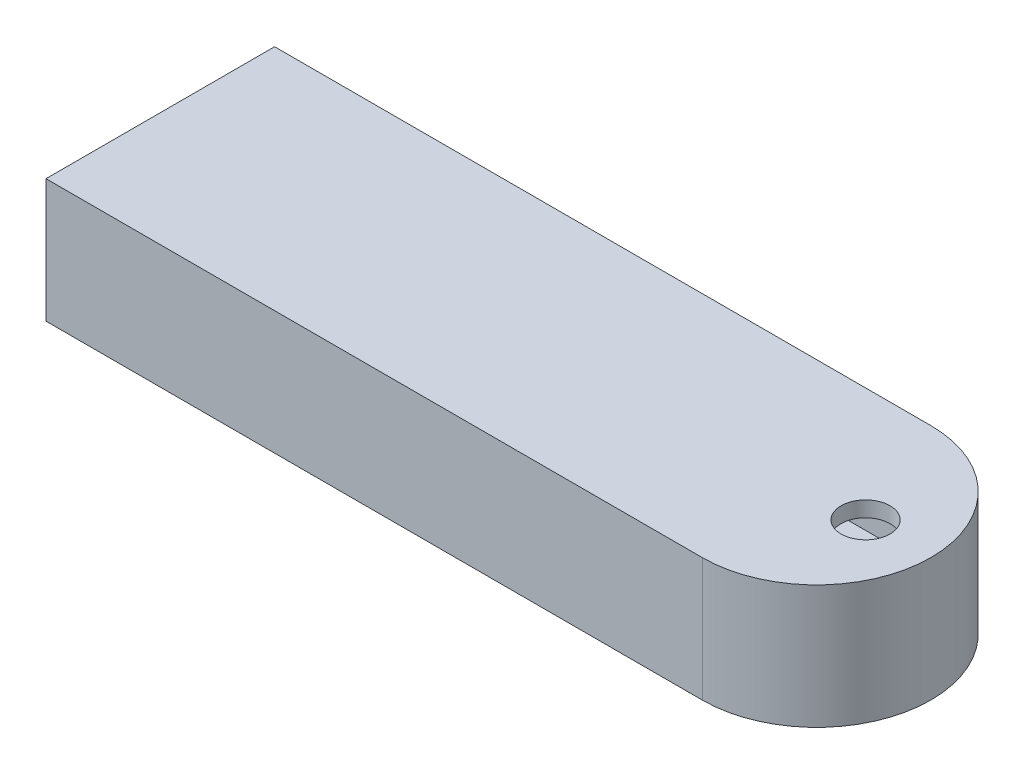
ISO-10303-21;
HEADER;
FILE_DESCRIPTION(('STEP AP214'),'2;1');
FILE_NAME('part.step','',(''),(''),'','','');
FILE_SCHEMA(('AUTOMOTIVE_DESIGN { 1 0 10303 214 1 1 1 1 }'));
ENDSEC;
DATA;
#1=APPLICATION_CONTEXT('core data for automotive mechanical design processes');
#2=APPLICATION_PROTOCOL_DEFINITION('international standard','automotive_design',2000,#1);
#3=PRODUCT_CONTEXT('',#1,'mechanical');
#4=PRODUCT('Part','Part','',(#3));
#5=PRODUCT_RELATED_PRODUCT_CATEGORY('part','',(#4));
#6=PRODUCT_DEFINITION_FORMATION('','',#4);
#7=PRODUCT_DEFINITION_CONTEXT('part definition',#1,'design');
#8=PRODUCT_DEFINITION('design','',#6,#7);
#9=PRODUCT_DEFINITION_SHAPE('','',#8);
#10=(LENGTH_UNIT() NAMED_UNIT(*) SI_UNIT(.MILLI.,.METRE.));
#11=(NAMED_UNIT(*) PLANE_ANGLE_UNIT() SI_UNIT($,.RADIAN.));
#12=(NAMED_UNIT(*) SI_UNIT($,.STERADIAN.) SOLID_ANGLE_UNIT());
#13=UNCERTAINTY_MEASURE_WITH_UNIT(LENGTH_MEASURE(1.E-05),#10,'distance_accuracy_value','');
#14=(GEOMETRIC_REPRESENTATION_CONTEXT(3) GLOBAL_UNCERTAINTY_ASSIGNED_CONTEXT((#13)) GLOBAL_UNIT_ASSIGNED_CONTEXT((#10,
#11,#12)) REPRESENTATION_CONTEXT('',''));
#15=CARTESIAN_POINT('',(0.,0.,0.));
#16=DIRECTION('',(0.,0.,1.));
#17=DIRECTION('',(1.,0.,0.));
#18=AXIS2_PLACEMENT_3D('',#15,#16,#17);
#19=CARTESIAN_POINT('',(33.4983346988671,15.9,-1.61404176251173));
#20=DIRECTION('',(0.,-1.,0.));
#21=DIRECTION('',(0.,0.,-1.));
#22=AXIS2_PLACEMENT_3D('',#19,#20,#21);
#23=CYLINDRICAL_SURFACE('',#22,3.155);
#24=CARTESIAN_POINT('',(33.4983346988671,13.9,-1.61404176251173));
#25=DIRECTION('',(0.,1.,0.));
#26=DIRECTION('',(0.,0.,1.));
#27=AXIS2_PLACEMENT_3D('',#24,#25,#26);
#28=CIRCLE('',#27,3.155);
#29=CARTESIAN_POINT('',(33.4983346988671,13.9,1.54095823748827));
#30=VERTEX_POINT('',#29);
#31=EDGE_CURVE('E178',#30,#30,#28,.T.);
#32=ORIENTED_EDGE('',*,*,#31,.F.);
#33=EDGE_LOOP('',(#32));
#34=FACE_BOUND('',#33,.T.);
#35=CARTESIAN_POINT('',(33.4983346988671,15.9,-1.61404176251173));
#36=DIRECTION('',(0.,1.,0.));
#37=DIRECTION('',(0.,0.,1.));
#38=AXIS2_PLACEMENT_3D('',#35,#36,#37);
#39=CIRCLE('',#38,3.155);
#40=CARTESIAN_POINT('',(33.4983346988671,15.9,1.54095823748827));
#41=VERTEX_POINT('',#40);
#42=EDGE_CURVE('E220',#41,#41,#39,.T.);
#43=ORIENTED_EDGE('',*,*,#42,.T.);
#44=EDGE_LOOP('',(#43));
#45=FACE_BOUND('',#44,.T.);
#46=ADVANCED_FACE('F64',(#34,#45),#23,.F.);
#47=CARTESIAN_POINT('',(-57.361665301133,15.9,-16.3390417625117));
#48=DIRECTION('',(1.,0.,0.));
#49=DIRECTION('',(0.,0.,-1.));
#50=AXIS2_PLACEMENT_3D('',#47,#48,#49);
#51=PLANE('',#50);
#52=DIRECTION('',(0.,0.,1.));
#53=VECTOR('',#52,1.);
#54=CARTESIAN_POINT('',(-57.361665301133,0.,-16.3390417625117));
#55=LINE('',#54,#53);
#56=CARTESIAN_POINT('',(-57.361665301133,0.,-16.3390417625117));
#57=VERTEX_POINT('',#56);
#58=CARTESIAN_POINT('',(-57.361665301133,0.,13.1109582374883));
#59=VERTEX_POINT('',#58);
#60=EDGE_CURVE('E194',#57,#59,#55,.T.);
#61=ORIENTED_EDGE('',*,*,#60,.T.);
#62=DIRECTION('',(0.,-1.,0.));
#63=VECTOR('',#62,1.);
#64=CARTESIAN_POINT('',(-57.361665301133,15.9,13.1109582374883));
#65=LINE('',#64,#63);
#66=CARTESIAN_POINT('',(-57.361665301133,15.9,13.1109582374883));
#67=VERTEX_POINT('',#66);
#68=EDGE_CURVE('E74',#67,#59,#65,.T.);
#69=ORIENTED_EDGE('',*,*,#68,.F.);
#70=DIRECTION('',(0.,0.,1.));
#71=VECTOR('',#70,1.);
#72=CARTESIAN_POINT('',(-57.361665301133,15.9,-16.3390417625117));
#73=LINE('',#72,#71);
#74=CARTESIAN_POINT('',(-57.361665301133,15.9,-16.3390417625117));
#75=VERTEX_POINT('',#74);
#76=EDGE_CURVE('E198',#75,#67,#73,.T.);
#77=ORIENTED_EDGE('',*,*,#76,.F.);
#78=DIRECTION('',(0.,-1.,0.));
#79=VECTOR('',#78,1.);
#80=CARTESIAN_POINT('',(-57.361665301133,15.9,-16.3390417625117));
#81=LINE('',#80,#79);
#82=EDGE_CURVE('E12',#75,#57,#81,.T.);
#83=ORIENTED_EDGE('',*,*,#82,.T.);
#84=EDGE_LOOP('',(#61,#69,#77,#83));
#85=FACE_BOUND('',#84,.T.);
#86=DIRECTION('',(0.,0.,1.));
#87=VECTOR('',#86,1.);
#88=CARTESIAN_POINT('',(-57.361665301133,2.,0.));
#89=LINE('',#88,#87);
#90=CARTESIAN_POINT('',(-57.361665301133,2.,-14.3390417625117));
#91=VERTEX_POINT('',#90);
#92=CARTESIAN_POINT('',(-57.361665301133,2.,11.1109582374883));
#93=VERTEX_POINT('',#92);
#94=EDGE_CURVE('E170',#91,#93,#89,.T.);
#95=ORIENTED_EDGE('',*,*,#94,.F.);
#96=DIRECTION('',(0.,-1.,0.));
#97=VECTOR('',#96,1.);
#98=CARTESIAN_POINT('',(-57.361665301133,15.9,-14.3390417625117));
#99=LINE('',#98,#97);
#100=CARTESIAN_POINT('',(-57.361665301133,13.9,-14.3390417625117));
#101=VERTEX_POINT('',#100);
#102=EDGE_CURVE('E183',#101,#91,#99,.T.);
#103=ORIENTED_EDGE('',*,*,#102,.F.);
#104=DIRECTION('',(0.,0.,1.));
#105=VECTOR('',#104,1.);
#106=CARTESIAN_POINT('',(-57.361665301133,13.9,0.));
#107=LINE('',#106,#105);
#108=CARTESIAN_POINT('',(-57.361665301133,13.9,11.1109582374883));
#109=VERTEX_POINT('',#108);
#110=EDGE_CURVE('E164',#101,#109,#107,.T.);
#111=ORIENTED_EDGE('',*,*,#110,.T.);
#112=DIRECTION('',(0.,-1.,0.));
#113=VECTOR('',#112,1.);
#114=CARTESIAN_POINT('',(-57.361665301133,15.9,11.1109582374883));
#115=LINE('',#114,#113);
#116=EDGE_CURVE('E149',#109,#93,#115,.T.);
#117=ORIENTED_EDGE('',*,*,#116,.T.);
#118=EDGE_LOOP('',(#95,#103,#111,#117));
#119=FACE_BOUND('',#118,.T.);
#120=ADVANCED_FACE('F240',(#85,#119),#51,.F.);
#121=CARTESIAN_POINT('',(-57.361665301133,15.9,13.1109582374883));
#122=DIRECTION('',(0.,0.,-1.));
#123=DIRECTION('',(-1.,0.,0.));
#124=AXIS2_PLACEMENT_3D('',#121,#122,#123);
#125=PLANE('',#124);
#126=DIRECTION('',(1.,0.,0.));
#127=VECTOR('',#126,1.);
#128=CARTESIAN_POINT('',(-57.361665301133,0.,13.1109582374883));
#129=LINE('',#128,#127);
#130=CARTESIAN_POINT('',(27.188334698867,0.,13.1109582374882));
#131=VERTEX_POINT('',#130);
#132=EDGE_CURVE('E205',#59,#131,#129,.T.);
#133=ORIENTED_EDGE('',*,*,#132,.T.);
#134=DIRECTION('',(0.,-1.,0.));
#135=VECTOR('',#134,1.);
#136=CARTESIAN_POINT('',(27.188334698867,15.9,13.1109582374882));
#137=LINE('',#136,#135);
#138=CARTESIAN_POINT('',(27.188334698867,15.9,13.1109582374882));
#139=VERTEX_POINT('',#138);
#140=EDGE_CURVE('E215',#139,#131,#137,.T.);
#141=ORIENTED_EDGE('',*,*,#140,.F.);
#142=DIRECTION('',(1.,0.,0.));
#143=VECTOR('',#142,1.);
#144=CARTESIAN_POINT('',(-57.361665301133,15.9,13.1109582374883));
#145=LINE('',#144,#143);
#146=EDGE_CURVE('E193',#67,#139,#145,.T.);
#147=ORIENTED_EDGE('',*,*,#146,.F.);
#148=ORIENTED_EDGE('',*,*,#68,.T.);
#149=EDGE_LOOP('',(#133,#141,#147,#148));
#150=FACE_BOUND('',#149,.T.);
#151=ADVANCED_FACE('F243',(#150),#125,.F.);
#152=CARTESIAN_POINT('',(-57.361665301133,15.9,-16.3390417625117));
#153=DIRECTION('',(0.,0.,-1.));
#154=DIRECTION('',(-1.,0.,0.));
#155=AXIS2_PLACEMENT_3D('',#152,#153,#154);
#156=PLANE('',#155);
#157=DIRECTION('',(1.,0.,0.));
#158=VECTOR('',#157,1.);
#159=CARTESIAN_POINT('',(-57.361665301133,0.,-16.3390417625117));
#160=LINE('',#159,#158);
#161=CARTESIAN_POINT('',(27.188334698867,0.,-16.3390417625117));
#162=VERTEX_POINT('',#161);
#163=EDGE_CURVE('E201',#57,#162,#160,.T.);
#164=ORIENTED_EDGE('',*,*,#163,.F.);
#165=ORIENTED_EDGE('',*,*,#82,.F.);
#166=DIRECTION('',(1.,0.,0.));
#167=VECTOR('',#166,1.);
#168=CARTESIAN_POINT('',(-57.361665301133,15.9,-16.3390417625117));
#169=LINE('',#168,#167);
#170=CARTESIAN_POINT('',(27.188334698867,15.9,-16.3390417625117));
#171=VERTEX_POINT('',#170);
#172=EDGE_CURVE('E190',#75,#171,#169,.T.);
#173=ORIENTED_EDGE('',*,*,#172,.T.);
#174=DIRECTION('',(0.,-1.,0.));
#175=VECTOR('',#174,1.);
#176=CARTESIAN_POINT('',(27.188334698867,15.9,-16.3390417625117));
#177=LINE('',#176,#175);
#178=EDGE_CURVE('E114',#171,#162,#177,.T.);
#179=ORIENTED_EDGE('',*,*,#178,.T.);
#180=EDGE_LOOP('',(#164,#165,#173,#179));
#181=FACE_BOUND('',#180,.T.);
#182=ADVANCED_FACE('F235',(#181),#156,.T.);
#183=CARTESIAN_POINT('',(0.,0.,0.));
#184=DIRECTION('',(0.,-1.,0.));
#185=DIRECTION('',(0.,0.,-1.));
#186=AXIS2_PLACEMENT_3D('',#183,#184,#185);
#187=PLANE('',#186);
#188=ORIENTED_EDGE('',*,*,#163,.T.);
#189=CARTESIAN_POINT('',(27.188334698867,0.,-1.61404176251173));
#190=DIRECTION('',(0.,1.,0.));
#191=DIRECTION('',(0.,0.,1.));
#192=AXIS2_PLACEMENT_3D('',#189,#190,#191);
#193=CIRCLE('',#192,14.7249999999999);
#194=EDGE_CURVE('E68',#131,#162,#193,.T.);
#195=ORIENTED_EDGE('',*,*,#194,.F.);
#196=ORIENTED_EDGE('',*,*,#132,.F.);
#197=ORIENTED_EDGE('',*,*,#60,.F.);
#198=EDGE_LOOP('',(#188,#195,#196,#197));
#199=FACE_BOUND('',#198,.T.);
#200=CARTESIAN_POINT('',(33.4983346988671,0.,-1.61404176251173));
#201=DIRECTION('',(0.,1.,0.));
#202=DIRECTION('',(0.,0.,1.));
#203=AXIS2_PLACEMENT_3D('',#200,#201,#202);
#204=CIRCLE('',#203,3.155);
#205=CARTESIAN_POINT('',(33.4983346988671,0.,1.54095823748827));
#206=VERTEX_POINT('',#205);
#207=EDGE_CURVE('E187',#206,#206,#204,.T.);
#208=ORIENTED_EDGE('',*,*,#207,.T.);
#209=EDGE_LOOP('',(#208));
#210=FACE_BOUND('',#209,.T.);
#211=ADVANCED_FACE('F233',(#199,#210),#187,.T.);
#212=CARTESIAN_POINT('',(0.,15.9,0.));
#213=DIRECTION('',(0.,-1.,0.));
#214=DIRECTION('',(0.,0.,-1.));
#215=AXIS2_PLACEMENT_3D('',#212,#213,#214);
#216=PLANE('',#215);
#217=ORIENTED_EDGE('',*,*,#146,.T.);
#218=CARTESIAN_POINT('',(27.188334698867,15.9,-1.61404176251173));
#219=DIRECTION('',(0.,1.,0.));
#220=DIRECTION('',(0.,0.,1.));
#221=AXIS2_PLACEMENT_3D('',#218,#219,#220);
#222=CIRCLE('',#221,14.7249999999999);
#223=EDGE_CURVE('E206',#139,#171,#222,.T.);
#224=ORIENTED_EDGE('',*,*,#223,.T.);
#225=ORIENTED_EDGE('',*,*,#172,.F.);
#226=ORIENTED_EDGE('',*,*,#76,.T.);
#227=EDGE_LOOP('',(#217,#224,#225,#226));
#228=FACE_BOUND('',#227,.T.);
#229=ORIENTED_EDGE('',*,*,#42,.F.);
#230=EDGE_LOOP('',(#229));
#231=FACE_BOUND('',#230,.T.);
#232=ADVANCED_FACE('F236',(#228,#231),#216,.F.);
#233=CARTESIAN_POINT('',(33.4983346988671,2.,-1.61404176251173));
#234=DIRECTION('',(0.,-1.,0.));
#235=DIRECTION('',(0.,0.,-1.));
#236=AXIS2_PLACEMENT_3D('',#233,#234,#235);
#237=CIRCLE('',#236,3.155);
#238=CARTESIAN_POINT('',(33.4983346988671,2.,-4.76904176251173));
#239=VERTEX_POINT('',#238);
#240=EDGE_CURVE('E378',#239,#239,#237,.T.);
#241=ORIENTED_EDGE('',*,*,#240,.F.);
#242=EDGE_LOOP('',(#241));
#243=FACE_BOUND('',#242,.T.);
#244=ORIENTED_EDGE('',*,*,#207,.F.);
#245=EDGE_LOOP('',(#244));
#246=FACE_BOUND('',#245,.T.);
#247=ADVANCED_FACE('F253',(#243,#246),#23,.F.);
#248=CARTESIAN_POINT('',(27.188334698867,15.9,-1.61404176251173));
#249=DIRECTION('',(0.,-1.,0.));
#250=DIRECTION('',(0.,0.,-1.));
#251=AXIS2_PLACEMENT_3D('',#248,#249,#250);
#252=CYLINDRICAL_SURFACE('',#251,14.7249999999999);
#253=ORIENTED_EDGE('',*,*,#140,.T.);
#254=ORIENTED_EDGE('',*,*,#194,.T.);
#255=ORIENTED_EDGE('',*,*,#178,.F.);
#256=ORIENTED_EDGE('',*,*,#223,.F.);
#257=EDGE_LOOP('',(#253,#254,#255,#256));
#258=FACE_BOUND('',#257,.T.);
#259=ADVANCED_FACE('F66',(#258),#252,.T.);
#260=CARTESIAN_POINT('',(-57.361665301133,15.9,11.1109582374883));
#261=DIRECTION('',(0.,0.,-1.));
#262=DIRECTION('',(-1.,0.,0.));
#263=AXIS2_PLACEMENT_3D('',#260,#261,#262);
#264=PLANE('',#263);
#265=DIRECTION('',(1.,0.,0.));
#266=VECTOR('',#265,1.);
#267=CARTESIAN_POINT('',(0.,2.,11.1109582374883));
#268=LINE('',#267,#266);
#269=CARTESIAN_POINT('',(27.188334698867,2.,11.1109582374882));
#270=VERTEX_POINT('',#269);
#271=EDGE_CURVE('E177',#93,#270,#268,.T.);
#272=ORIENTED_EDGE('',*,*,#271,.F.);
#273=ORIENTED_EDGE('',*,*,#116,.F.);
#274=DIRECTION('',(1.,0.,0.));
#275=VECTOR('',#274,1.);
#276=CARTESIAN_POINT('',(0.,13.9,11.1109582374883));
#277=LINE('',#276,#275);
#278=CARTESIAN_POINT('',(27.188334698867,13.9,11.1109582374882));
#279=VERTEX_POINT('',#278);
#280=EDGE_CURVE('E156',#109,#279,#277,.T.);
#281=ORIENTED_EDGE('',*,*,#280,.T.);
#282=DIRECTION('',(0.,-1.,0.));
#283=VECTOR('',#282,1.);
#284=CARTESIAN_POINT('',(27.188334698867,15.9,11.1109582374882));
#285=LINE('',#284,#283);
#286=EDGE_CURVE('E138',#279,#270,#285,.T.);
#287=ORIENTED_EDGE('',*,*,#286,.T.);
#288=EDGE_LOOP('',(#272,#273,#281,#287));
#289=FACE_BOUND('',#288,.T.);
#290=ADVANCED_FACE('F161',(#289),#264,.T.);
#291=CARTESIAN_POINT('',(-57.361665301133,15.9,-14.3390417625117));
#292=DIRECTION('',(0.,0.,-1.));
#293=DIRECTION('',(-1.,0.,0.));
#294=AXIS2_PLACEMENT_3D('',#291,#292,#293);
#295=PLANE('',#294);
#296=DIRECTION('',(1.,0.,0.));
#297=VECTOR('',#296,1.);
#298=CARTESIAN_POINT('',(0.,2.,-14.3390417625117));
#299=LINE('',#298,#297);
#300=CARTESIAN_POINT('',(27.188334698867,2.,-14.3390417625117));
#301=VERTEX_POINT('',#300);
#302=EDGE_CURVE('E159',#91,#301,#299,.T.);
#303=ORIENTED_EDGE('',*,*,#302,.T.);
#304=DIRECTION('',(0.,1.,0.));
#305=VECTOR('',#304,1.);
#306=CARTESIAN_POINT('',(27.188334698867,15.9,-14.3390417625117));
#307=LINE('',#306,#305);
#308=CARTESIAN_POINT('',(27.188334698867,13.9,-14.3390417625117));
#309=VERTEX_POINT('',#308);
#310=EDGE_CURVE('E150',#309,#301,#307,.F.);
#311=ORIENTED_EDGE('',*,*,#310,.F.);
#312=DIRECTION('',(1.,0.,0.));
#313=VECTOR('',#312,1.);
#314=CARTESIAN_POINT('',(0.,13.9,-14.3390417625117));
#315=LINE('',#314,#313);
#316=EDGE_CURVE('E82',#101,#309,#315,.T.);
#317=ORIENTED_EDGE('',*,*,#316,.F.);
#318=ORIENTED_EDGE('',*,*,#102,.T.);
#319=EDGE_LOOP('',(#303,#311,#317,#318));
#320=FACE_BOUND('',#319,.T.);
#321=ADVANCED_FACE('F266',(#320),#295,.F.);
#322=CARTESIAN_POINT('',(0.,2.,0.));
#323=DIRECTION('',(0.,-1.,0.));
#324=DIRECTION('',(0.,0.,-1.));
#325=AXIS2_PLACEMENT_3D('',#322,#323,#324);
#326=PLANE('',#325);
#327=ORIENTED_EDGE('',*,*,#302,.F.);
#328=ORIENTED_EDGE('',*,*,#94,.T.);
#329=ORIENTED_EDGE('',*,*,#271,.T.);
#330=CARTESIAN_POINT('',(27.188334698867,2.,-1.61404176251173));
#331=DIRECTION('',(0.,-1.,0.));
#332=DIRECTION('',(0.,0.,-1.));
#333=AXIS2_PLACEMENT_3D('',#330,#331,#332);
#334=CIRCLE('',#333,12.7249999999999);
#335=EDGE_CURVE('E143',#270,#301,#334,.F.);
#336=ORIENTED_EDGE('',*,*,#335,.T.);
#337=EDGE_LOOP('',(#327,#328,#329,#336));
#338=FACE_BOUND('',#337,.T.);
#339=ORIENTED_EDGE('',*,*,#240,.T.);
#340=EDGE_LOOP('',(#339));
#341=FACE_BOUND('',#340,.T.);
#342=ADVANCED_FACE('F270',(#338,#341),#326,.F.);
#343=CARTESIAN_POINT('',(0.,13.9,0.));
#344=DIRECTION('',(0.,-1.,0.));
#345=DIRECTION('',(0.,0.,-1.));
#346=AXIS2_PLACEMENT_3D('',#343,#344,#345);
#347=PLANE('',#346);
#348=ORIENTED_EDGE('',*,*,#280,.F.);
#349=ORIENTED_EDGE('',*,*,#110,.F.);
#350=ORIENTED_EDGE('',*,*,#316,.T.);
#351=CARTESIAN_POINT('',(27.188334698867,13.9,-1.61404176251173));
#352=DIRECTION('',(0.,-1.,0.));
#353=DIRECTION('',(0.,0.,-1.));
#354=AXIS2_PLACEMENT_3D('',#351,#352,#353);
#355=CIRCLE('',#354,12.7249999999999);
#356=EDGE_CURVE('E141',#279,#309,#355,.F.);
#357=ORIENTED_EDGE('',*,*,#356,.F.);
#358=EDGE_LOOP('',(#348,#349,#350,#357));
#359=FACE_BOUND('',#358,.T.);
#360=ORIENTED_EDGE('',*,*,#31,.T.);
#361=EDGE_LOOP('',(#360));
#362=FACE_BOUND('',#361,.T.);
#363=ADVANCED_FACE('F154',(#359,#362),#347,.T.);
#364=CARTESIAN_POINT('',(27.188334698867,15.9,-1.61404176251173));
#365=DIRECTION('',(0.,-1.,0.));
#366=DIRECTION('',(0.,0.,-1.));
#367=AXIS2_PLACEMENT_3D('',#364,#365,#366);
#368=CYLINDRICAL_SURFACE('',#367,12.7249999999999);
#369=ORIENTED_EDGE('',*,*,#286,.F.);
#370=ORIENTED_EDGE('',*,*,#356,.T.);
#371=ORIENTED_EDGE('',*,*,#310,.T.);
#372=ORIENTED_EDGE('',*,*,#335,.F.);
#373=EDGE_LOOP('',(#369,#370,#371,#372));
#374=FACE_BOUND('',#373,.T.);
#375=ADVANCED_FACE('F140',(#374),#368,.F.);
#376=CLOSED_SHELL('',(#46,#120,#151,#182,#211,#232,#247,#259,#290,#321,#342,#363,#375));
#377=MANIFOLD_SOLID_BREP('B2',#376);
#378=ADVANCED_BREP_SHAPE_REPRESENTATION('',(#18,#377),#14);
#379=SHAPE_DEFINITION_REPRESENTATION(#9,#378);
ENDSEC;
END-ISO-10303-21;
